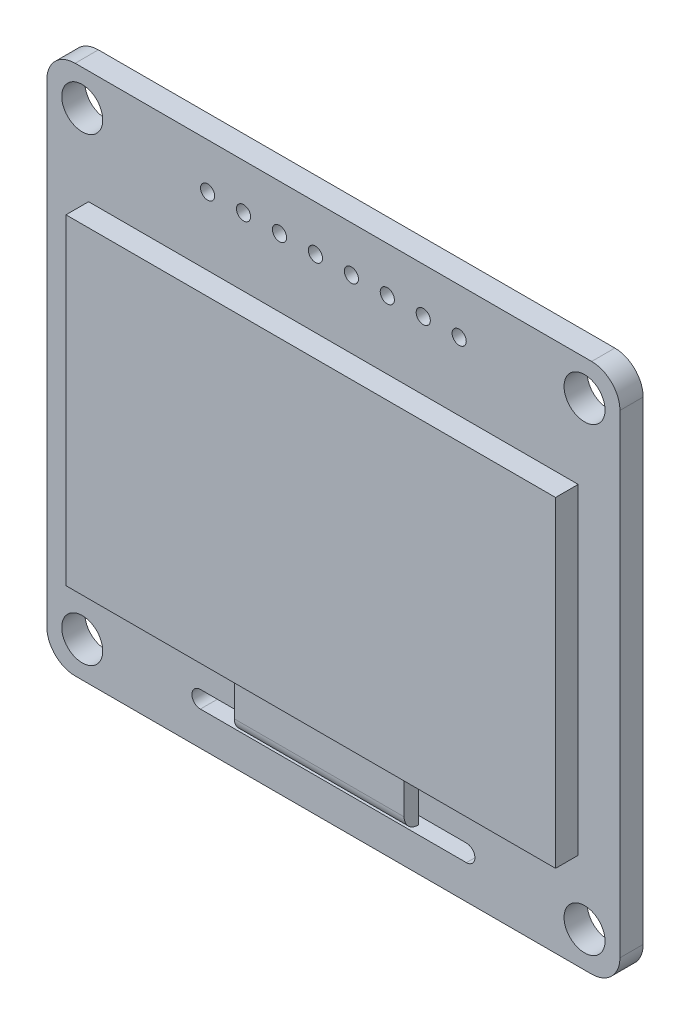
ISO-10303-21;
HEADER;
FILE_DESCRIPTION(('STEP AP214'),'2;1');
FILE_NAME('part.step','',(''),(''),'','','');
FILE_SCHEMA(('AUTOMOTIVE_DESIGN { 1 0 10303 214 1 1 1 1 }'));
ENDSEC;
DATA;
#1=APPLICATION_CONTEXT('core data for automotive mechanical design processes');
#2=APPLICATION_PROTOCOL_DEFINITION('international standard','automotive_design',2000,#1);
#3=PRODUCT_CONTEXT('',#1,'mechanical');
#4=PRODUCT('Part','Part','',(#3));
#5=PRODUCT_RELATED_PRODUCT_CATEGORY('part','',(#4));
#6=PRODUCT_DEFINITION_FORMATION('','',#4);
#7=PRODUCT_DEFINITION_CONTEXT('part definition',#1,'design');
#8=PRODUCT_DEFINITION('design','',#6,#7);
#9=PRODUCT_DEFINITION_SHAPE('','',#8);
#10=(LENGTH_UNIT() NAMED_UNIT(*) SI_UNIT(.MILLI.,.METRE.));
#11=(NAMED_UNIT(*) PLANE_ANGLE_UNIT() SI_UNIT($,.RADIAN.));
#12=(NAMED_UNIT(*) SI_UNIT($,.STERADIAN.) SOLID_ANGLE_UNIT());
#13=UNCERTAINTY_MEASURE_WITH_UNIT(LENGTH_MEASURE(1.E-05),#10,'distance_accuracy_value','');
#14=(GEOMETRIC_REPRESENTATION_CONTEXT(3) GLOBAL_UNCERTAINTY_ASSIGNED_CONTEXT((#13)) GLOBAL_UNIT_ASSIGNED_CONTEXT((#10,
#11,#12)) REPRESENTATION_CONTEXT('',''));
#15=CARTESIAN_POINT('',(0.,0.,0.));
#16=DIRECTION('',(0.,0.,1.));
#17=DIRECTION('',(1.,0.,0.));
#18=AXIS2_PLACEMENT_3D('',#15,#16,#17);
#19=CARTESIAN_POINT('',(6.,-14.75,1.64));
#20=DIRECTION('',(-1.,0.,0.));
#21=DIRECTION('',(0.,0.,1.));
#22=AXIS2_PLACEMENT_3D('',#19,#20,#21);
#23=CYLINDRICAL_SURFACE('',#22,1.);
#24=DIRECTION('',(1.,0.,0.));
#25=VECTOR('',#24,1.);
#26=CARTESIAN_POINT('',(0.,-15.75,1.64));
#27=LINE('',#26,#25);
#28=CARTESIAN_POINT('',(-6.,-15.75,1.64));
#29=VERTEX_POINT('',#28);
#30=CARTESIAN_POINT('',(6.,-15.75,1.64));
#31=VERTEX_POINT('',#30);
#32=EDGE_CURVE('E243',#29,#31,#27,.T.);
#33=ORIENTED_EDGE('',*,*,#32,.T.);
#34=CARTESIAN_POINT('',(6.,-14.75,1.64));
#35=DIRECTION('',(-1.,0.,0.));
#36=DIRECTION('',(0.,0.,1.));
#37=AXIS2_PLACEMENT_3D('',#34,#35,#36);
#38=CIRCLE('',#37,1.);
#39=CARTESIAN_POINT('',(6.,-14.75,2.64));
#40=VERTEX_POINT('',#39);
#41=EDGE_CURVE('E20',#40,#31,#38,.F.);
#42=ORIENTED_EDGE('',*,*,#41,.F.);
#43=DIRECTION('',(1.,0.,0.));
#44=VECTOR('',#43,1.);
#45=CARTESIAN_POINT('',(0.,-14.75,2.64));
#46=LINE('',#45,#44);
#47=CARTESIAN_POINT('',(-6.,-14.75,2.64));
#48=VERTEX_POINT('',#47);
#49=EDGE_CURVE('E244',#48,#40,#46,.T.);
#50=ORIENTED_EDGE('',*,*,#49,.F.);
#51=CARTESIAN_POINT('',(-6.,-14.75,1.64));
#52=DIRECTION('',(-1.,0.,0.));
#53=DIRECTION('',(0.,0.,1.));
#54=AXIS2_PLACEMENT_3D('',#51,#52,#53);
#55=CIRCLE('',#54,1.);
#56=EDGE_CURVE('E246',#29,#48,#55,.T.);
#57=ORIENTED_EDGE('',*,*,#56,.F.);
#58=EDGE_LOOP('',(#33,#42,#50,#57));
#59=FACE_BOUND('',#58,.T.);
#60=ADVANCED_FACE('F16',(#59),#23,.T.);
#61=CARTESIAN_POINT('',(-17.3,-11.95,3.24));
#62=DIRECTION('',(0.,0.,1.));
#63=DIRECTION('',(1.,0.,0.));
#64=AXIS2_PLACEMENT_3D('',#61,#62,#63);
#65=PLANE('',#64);
#66=DIRECTION('',(0.,1.,0.));
#67=VECTOR('',#66,1.);
#68=CARTESIAN_POINT('',(17.3,-0.6,3.24));
#69=LINE('',#68,#67);
#70=CARTESIAN_POINT('',(17.3,-11.95,3.24));
#71=VERTEX_POINT('',#70);
#72=CARTESIAN_POINT('',(17.3,10.75,3.24));
#73=VERTEX_POINT('',#72);
#74=EDGE_CURVE('E252',#71,#73,#69,.T.);
#75=ORIENTED_EDGE('',*,*,#74,.T.);
#76=DIRECTION('',(-1.,0.,0.));
#77=VECTOR('',#76,1.);
#78=CARTESIAN_POINT('',(0.,10.75,3.24));
#79=LINE('',#78,#77);
#80=CARTESIAN_POINT('',(-17.3,10.75,3.24));
#81=VERTEX_POINT('',#80);
#82=EDGE_CURVE('E263',#73,#81,#79,.T.);
#83=ORIENTED_EDGE('',*,*,#82,.T.);
#84=DIRECTION('',(0.,-1.,0.));
#85=VECTOR('',#84,1.);
#86=CARTESIAN_POINT('',(-17.3,-0.6,3.24));
#87=LINE('',#86,#85);
#88=CARTESIAN_POINT('',(-17.3,-11.95,3.24));
#89=VERTEX_POINT('',#88);
#90=EDGE_CURVE('E214',#81,#89,#87,.T.);
#91=ORIENTED_EDGE('',*,*,#90,.T.);
#92=DIRECTION('',(1.,0.,0.));
#93=VECTOR('',#92,1.);
#94=CARTESIAN_POINT('',(0.,-11.95,3.24));
#95=LINE('',#94,#93);
#96=EDGE_CURVE('E204',#89,#71,#95,.T.);
#97=ORIENTED_EDGE('',*,*,#96,.T.);
#98=EDGE_LOOP('',(#75,#83,#91,#97));
#99=FACE_BOUND('',#98,.T.);
#100=ADVANCED_FACE('F833',(#99),#65,.T.);
#101=CARTESIAN_POINT('',(-6.,-14.75,2.64));
#102=DIRECTION('',(0.,0.,1.));
#103=DIRECTION('',(1.,0.,0.));
#104=AXIS2_PLACEMENT_3D('',#101,#102,#103);
#105=PLANE('',#104);
#106=DIRECTION('',(0.,1.,0.));
#107=VECTOR('',#106,1.);
#108=CARTESIAN_POINT('',(6.,-13.8614,2.64));
#109=LINE('',#108,#107);
#110=CARTESIAN_POINT('',(6.00000000433333,-11.95,2.64));
#111=VERTEX_POINT('',#110);
#112=EDGE_CURVE('E384',#40,#111,#109,.T.);
#113=ORIENTED_EDGE('',*,*,#112,.T.);
#114=DIRECTION('',(-1.,0.,0.));
#115=VECTOR('',#114,1.);
#116=CARTESIAN_POINT('',(0.,-11.95,2.64));
#117=LINE('',#116,#115);
#118=CARTESIAN_POINT('',(-6.00000000866666,-11.95,2.64));
#119=VERTEX_POINT('',#118);
#120=EDGE_CURVE('E133',#111,#119,#117,.T.);
#121=ORIENTED_EDGE('',*,*,#120,.T.);
#122=DIRECTION('',(0.,-1.,0.));
#123=VECTOR('',#122,1.);
#124=CARTESIAN_POINT('',(-6.,-13.8614,2.64));
#125=LINE('',#124,#123);
#126=EDGE_CURVE('E187',#119,#48,#125,.T.);
#127=ORIENTED_EDGE('',*,*,#126,.T.);
#128=ORIENTED_EDGE('',*,*,#49,.T.);
#129=EDGE_LOOP('',(#113,#121,#127,#128));
#130=FACE_BOUND('',#129,.T.);
#131=ADVANCED_FACE('F383',(#130),#105,.T.);
#132=CARTESIAN_POINT('',(-6.,-15.75,1.64));
#133=DIRECTION('',(0.,0.,1.));
#134=DIRECTION('',(1.,0.,0.));
#135=AXIS2_PLACEMENT_3D('',#132,#133,#134);
#136=PLANE('',#135);
#137=DIRECTION('',(1.,0.,0.));
#138=VECTOR('',#137,1.);
#139=CARTESIAN_POINT('',(0.,-15.15,1.64));
#140=LINE('',#139,#138);
#141=CARTESIAN_POINT('',(-5.9999999962,-15.1500000004219,1.64));
#142=VERTEX_POINT('',#141);
#143=CARTESIAN_POINT('',(5.9999999955,-15.1500000004219,1.64));
#144=VERTEX_POINT('',#143);
#145=EDGE_CURVE('E168',#142,#144,#140,.T.);
#146=ORIENTED_EDGE('',*,*,#145,.T.);
#147=DIRECTION('',(0.,-1.,0.));
#148=VECTOR('',#147,1.);
#149=CARTESIAN_POINT('',(6.,-13.8614,1.64));
#150=LINE('',#149,#148);
#151=EDGE_CURVE('E385',#144,#31,#150,.T.);
#152=ORIENTED_EDGE('',*,*,#151,.T.);
#153=ORIENTED_EDGE('',*,*,#32,.F.);
#154=DIRECTION('',(0.,1.,0.));
#155=VECTOR('',#154,1.);
#156=CARTESIAN_POINT('',(-6.,-13.8614,1.64));
#157=LINE('',#156,#155);
#158=EDGE_CURVE('E212',#29,#142,#157,.T.);
#159=ORIENTED_EDGE('',*,*,#158,.T.);
#160=EDGE_LOOP('',(#146,#152,#153,#159));
#161=FACE_BOUND('',#160,.T.);
#162=ADVANCED_FACE('F817',(#161),#136,.F.);
#163=CARTESIAN_POINT('',(-20.25,-16.75,0.));
#164=DIRECTION('',(1.,0.,0.));
#165=DIRECTION('',(0.,1.,0.));
#166=AXIS2_PLACEMENT_3D('',#163,#164,#165);
#167=PLANE('',#166);
#168=DIRECTION('',(0.,0.,-1.));
#169=VECTOR('',#168,1.);
#170=CARTESIAN_POINT('',(-20.25,-16.7500000003592,0.82));
#171=LINE('',#170,#169);
#172=CARTESIAN_POINT('',(-20.25,-16.7500000001796,0.));
#173=VERTEX_POINT('',#172);
#174=CARTESIAN_POINT('',(-20.25,-16.7500000001796,1.64));
#175=VERTEX_POINT('',#174);
#176=EDGE_CURVE('E240',#173,#175,#171,.F.);
#177=ORIENTED_EDGE('',*,*,#176,.T.);
#178=DIRECTION('',(0.,-1.,0.));
#179=VECTOR('',#178,1.);
#180=CARTESIAN_POINT('',(-20.25,0.,1.64));
#181=LINE('',#180,#179);
#182=CARTESIAN_POINT('',(-20.25,16.75,1.64));
#183=VERTEX_POINT('',#182);
#184=EDGE_CURVE('E322',#183,#175,#181,.T.);
#185=ORIENTED_EDGE('',*,*,#184,.F.);
#186=DIRECTION('',(0.,0.,1.));
#187=VECTOR('',#186,1.);
#188=CARTESIAN_POINT('',(-20.25,16.75,0.82));
#189=LINE('',#188,#187);
#190=CARTESIAN_POINT('',(-20.25,16.75,0.));
#191=VERTEX_POINT('',#190);
#192=EDGE_CURVE('E223',#183,#191,#189,.F.);
#193=ORIENTED_EDGE('',*,*,#192,.T.);
#194=DIRECTION('',(0.,-1.,0.));
#195=VECTOR('',#194,1.);
#196=CARTESIAN_POINT('',(-20.25,0.,0.));
#197=LINE('',#196,#195);
#198=EDGE_CURVE('E368',#191,#173,#197,.T.);
#199=ORIENTED_EDGE('',*,*,#198,.T.);
#200=EDGE_LOOP('',(#177,#185,#193,#199));
#201=FACE_BOUND('',#200,.T.);
#202=ADVANCED_FACE('F488',(#201),#167,.F.);
#203=CARTESIAN_POINT('',(-18.25,-16.75,1.64));
#204=DIRECTION('',(0.,0.,-1.));
#205=DIRECTION('',(0.,1.,0.));
#206=AXIS2_PLACEMENT_3D('',#203,#204,#205);
#207=CYLINDRICAL_SURFACE('',#206,2.);
#208=ORIENTED_EDGE('',*,*,#176,.F.);
#209=CARTESIAN_POINT('',(-18.25,-16.75,0.));
#210=DIRECTION('',(0.,0.,-1.));
#211=DIRECTION('',(0.,1.,0.));
#212=AXIS2_PLACEMENT_3D('',#209,#210,#211);
#213=CIRCLE('',#212,2.);
#214=CARTESIAN_POINT('',(-18.25,-18.75,0.));
#215=VERTEX_POINT('',#214);
#216=EDGE_CURVE('E365',#173,#215,#213,.F.);
#217=ORIENTED_EDGE('',*,*,#216,.T.);
#218=DIRECTION('',(0.,0.,1.));
#219=VECTOR('',#218,1.);
#220=CARTESIAN_POINT('',(-18.25,-18.75,0.82));
#221=LINE('',#220,#219);
#222=CARTESIAN_POINT('',(-18.25,-18.75,1.64));
#223=VERTEX_POINT('',#222);
#224=EDGE_CURVE('E237',#215,#223,#221,.T.);
#225=ORIENTED_EDGE('',*,*,#224,.T.);
#226=CARTESIAN_POINT('',(-18.25,-16.75,1.64));
#227=DIRECTION('',(0.,0.,-1.));
#228=DIRECTION('',(0.,1.,0.));
#229=AXIS2_PLACEMENT_3D('',#226,#227,#228);
#230=CIRCLE('',#229,2.);
#231=EDGE_CURVE('E320',#175,#223,#230,.F.);
#232=ORIENTED_EDGE('',*,*,#231,.F.);
#233=EDGE_LOOP('',(#208,#217,#225,#232));
#234=FACE_BOUND('',#233,.T.);
#235=ADVANCED_FACE('F495',(#234),#207,.T.);
#236=CARTESIAN_POINT('',(-18.25,-18.75,0.));
#237=DIRECTION('',(0.,1.,0.));
#238=DIRECTION('',(0.,0.,1.));
#239=AXIS2_PLACEMENT_3D('',#236,#237,#238);
#240=PLANE('',#239);
#241=ORIENTED_EDGE('',*,*,#224,.F.);
#242=DIRECTION('',(1.,0.,0.));
#243=VECTOR('',#242,1.);
#244=CARTESIAN_POINT('',(0.,-18.75,0.));
#245=LINE('',#244,#243);
#246=CARTESIAN_POINT('',(18.2500000003847,-18.75,0.));
#247=VERTEX_POINT('',#246);
#248=EDGE_CURVE('E364',#215,#247,#245,.T.);
#249=ORIENTED_EDGE('',*,*,#248,.T.);
#250=DIRECTION('',(0.,0.,-1.));
#251=VECTOR('',#250,1.);
#252=CARTESIAN_POINT('',(18.2500000007694,-18.75,0.82));
#253=LINE('',#252,#251);
#254=CARTESIAN_POINT('',(18.2500000003847,-18.75,1.64));
#255=VERTEX_POINT('',#254);
#256=EDGE_CURVE('E234',#247,#255,#253,.F.);
#257=ORIENTED_EDGE('',*,*,#256,.T.);
#258=DIRECTION('',(1.,0.,0.));
#259=VECTOR('',#258,1.);
#260=CARTESIAN_POINT('',(0.,-18.75,1.64));
#261=LINE('',#260,#259);
#262=EDGE_CURVE('E319',#223,#255,#261,.T.);
#263=ORIENTED_EDGE('',*,*,#262,.F.);
#264=EDGE_LOOP('',(#241,#249,#257,#263));
#265=FACE_BOUND('',#264,.T.);
#266=ADVANCED_FACE('F500',(#265),#240,.F.);
#267=CARTESIAN_POINT('',(18.25,-16.75,1.64));
#268=DIRECTION('',(0.,0.,-1.));
#269=DIRECTION('',(0.,1.,0.));
#270=AXIS2_PLACEMENT_3D('',#267,#268,#269);
#271=CYLINDRICAL_SURFACE('',#270,2.);
#272=ORIENTED_EDGE('',*,*,#256,.F.);
#273=CARTESIAN_POINT('',(18.25,-16.75,0.));
#274=DIRECTION('',(0.,0.,-1.));
#275=DIRECTION('',(0.,1.,0.));
#276=AXIS2_PLACEMENT_3D('',#273,#274,#275);
#277=CIRCLE('',#276,2.);
#278=CARTESIAN_POINT('',(20.25,-16.75,0.));
#279=VERTEX_POINT('',#278);
#280=EDGE_CURVE('E377',#247,#279,#277,.F.);
#281=ORIENTED_EDGE('',*,*,#280,.T.);
#282=DIRECTION('',(0.,0.,1.));
#283=VECTOR('',#282,1.);
#284=CARTESIAN_POINT('',(20.25,-16.75,0.82));
#285=LINE('',#284,#283);
#286=CARTESIAN_POINT('',(20.25,-16.75,1.64));
#287=VERTEX_POINT('',#286);
#288=EDGE_CURVE('E231',#279,#287,#285,.T.);
#289=ORIENTED_EDGE('',*,*,#288,.T.);
#290=CARTESIAN_POINT('',(18.25,-16.75,1.64));
#291=DIRECTION('',(0.,0.,-1.));
#292=DIRECTION('',(0.,1.,0.));
#293=AXIS2_PLACEMENT_3D('',#290,#291,#292);
#294=CIRCLE('',#293,2.);
#295=EDGE_CURVE('E317',#255,#287,#294,.F.);
#296=ORIENTED_EDGE('',*,*,#295,.F.);
#297=EDGE_LOOP('',(#272,#281,#289,#296));
#298=FACE_BOUND('',#297,.T.);
#299=ADVANCED_FACE('F502',(#298),#271,.T.);
#300=CARTESIAN_POINT('',(20.25,16.75,0.));
#301=DIRECTION('',(-1.,0.,0.));
#302=DIRECTION('',(0.,-1.,0.));
#303=AXIS2_PLACEMENT_3D('',#300,#301,#302);
#304=PLANE('',#303);
#305=ORIENTED_EDGE('',*,*,#288,.F.);
#306=DIRECTION('',(0.,1.,0.));
#307=VECTOR('',#306,1.);
#308=CARTESIAN_POINT('',(20.25,0.,0.));
#309=LINE('',#308,#307);
#310=CARTESIAN_POINT('',(20.25,16.7499999995898,0.));
#311=VERTEX_POINT('',#310);
#312=EDGE_CURVE('E376',#279,#311,#309,.T.);
#313=ORIENTED_EDGE('',*,*,#312,.T.);
#314=DIRECTION('',(0.,0.,-1.));
#315=VECTOR('',#314,1.);
#316=CARTESIAN_POINT('',(20.25,16.7499999991796,0.82));
#317=LINE('',#316,#315);
#318=CARTESIAN_POINT('',(20.25,16.7499999995898,1.64));
#319=VERTEX_POINT('',#318);
#320=EDGE_CURVE('E228',#311,#319,#317,.F.);
#321=ORIENTED_EDGE('',*,*,#320,.T.);
#322=DIRECTION('',(0.,1.,0.));
#323=VECTOR('',#322,1.);
#324=CARTESIAN_POINT('',(20.25,0.,1.64));
#325=LINE('',#324,#323);
#326=EDGE_CURVE('E316',#287,#319,#325,.T.);
#327=ORIENTED_EDGE('',*,*,#326,.F.);
#328=EDGE_LOOP('',(#305,#313,#321,#327));
#329=FACE_BOUND('',#328,.T.);
#330=ADVANCED_FACE('F506',(#329),#304,.F.);
#331=CARTESIAN_POINT('',(18.25,16.75,1.64));
#332=DIRECTION('',(0.,0.,-1.));
#333=DIRECTION('',(0.,1.,0.));
#334=AXIS2_PLACEMENT_3D('',#331,#332,#333);
#335=CYLINDRICAL_SURFACE('',#334,2.);
#336=ORIENTED_EDGE('',*,*,#320,.F.);
#337=CARTESIAN_POINT('',(18.25,16.75,0.));
#338=DIRECTION('',(0.,0.,-1.));
#339=DIRECTION('',(0.,1.,0.));
#340=AXIS2_PLACEMENT_3D('',#337,#338,#339);
#341=CIRCLE('',#340,2.);
#342=CARTESIAN_POINT('',(18.25,18.75,0.));
#343=VERTEX_POINT('',#342);
#344=EDGE_CURVE('E373',#311,#343,#341,.F.);
#345=ORIENTED_EDGE('',*,*,#344,.T.);
#346=DIRECTION('',(0.,0.,1.));
#347=VECTOR('',#346,1.);
#348=CARTESIAN_POINT('',(18.25,18.75,0.82));
#349=LINE('',#348,#347);
#350=CARTESIAN_POINT('',(18.25,18.75,1.64));
#351=VERTEX_POINT('',#350);
#352=EDGE_CURVE('E225',#343,#351,#349,.T.);
#353=ORIENTED_EDGE('',*,*,#352,.T.);
#354=CARTESIAN_POINT('',(18.25,16.75,1.64));
#355=DIRECTION('',(0.,0.,-1.));
#356=DIRECTION('',(0.,1.,0.));
#357=AXIS2_PLACEMENT_3D('',#354,#355,#356);
#358=CIRCLE('',#357,2.);
#359=EDGE_CURVE('E314',#319,#351,#358,.F.);
#360=ORIENTED_EDGE('',*,*,#359,.F.);
#361=EDGE_LOOP('',(#336,#345,#353,#360));
#362=FACE_BOUND('',#361,.T.);
#363=ADVANCED_FACE('F509',(#362),#335,.T.);
#364=CARTESIAN_POINT('',(-18.25,18.75,1.64));
#365=DIRECTION('',(0.,-1.,0.));
#366=DIRECTION('',(0.,0.,-1.));
#367=AXIS2_PLACEMENT_3D('',#364,#365,#366);
#368=PLANE('',#367);
#369=ORIENTED_EDGE('',*,*,#352,.F.);
#370=DIRECTION('',(-1.,0.,0.));
#371=VECTOR('',#370,1.);
#372=CARTESIAN_POINT('',(0.,18.75,0.));
#373=LINE('',#372,#371);
#374=CARTESIAN_POINT('',(-18.2499999997949,18.75,0.));
#375=VERTEX_POINT('',#374);
#376=EDGE_CURVE('E372',#343,#375,#373,.T.);
#377=ORIENTED_EDGE('',*,*,#376,.T.);
#378=DIRECTION('',(0.,0.,-1.));
#379=VECTOR('',#378,1.);
#380=CARTESIAN_POINT('',(-18.2499999995898,18.75,0.82));
#381=LINE('',#380,#379);
#382=CARTESIAN_POINT('',(-18.2499999997949,18.75,1.64));
#383=VERTEX_POINT('',#382);
#384=EDGE_CURVE('E218',#375,#383,#381,.F.);
#385=ORIENTED_EDGE('',*,*,#384,.T.);
#386=DIRECTION('',(-1.,0.,0.));
#387=VECTOR('',#386,1.);
#388=CARTESIAN_POINT('',(0.,18.75,1.64));
#389=LINE('',#388,#387);
#390=EDGE_CURVE('E313',#351,#383,#389,.T.);
#391=ORIENTED_EDGE('',*,*,#390,.F.);
#392=EDGE_LOOP('',(#369,#377,#385,#391));
#393=FACE_BOUND('',#392,.T.);
#394=ADVANCED_FACE('F481',(#393),#368,.F.);
#395=CARTESIAN_POINT('',(-18.25,16.75,1.64));
#396=DIRECTION('',(0.,0.,-1.));
#397=DIRECTION('',(0.,1.,0.));
#398=AXIS2_PLACEMENT_3D('',#395,#396,#397);
#399=CYLINDRICAL_SURFACE('',#398,2.);
#400=ORIENTED_EDGE('',*,*,#384,.F.);
#401=CARTESIAN_POINT('',(-18.25,16.75,0.));
#402=DIRECTION('',(0.,0.,-1.));
#403=DIRECTION('',(0.,1.,0.));
#404=AXIS2_PLACEMENT_3D('',#401,#402,#403);
#405=CIRCLE('',#404,2.);
#406=EDGE_CURVE('E369',#375,#191,#405,.F.);
#407=ORIENTED_EDGE('',*,*,#406,.T.);
#408=ORIENTED_EDGE('',*,*,#192,.F.);
#409=CARTESIAN_POINT('',(-18.25,16.75,1.64));
#410=DIRECTION('',(0.,0.,-1.));
#411=DIRECTION('',(0.,1.,0.));
#412=AXIS2_PLACEMENT_3D('',#409,#410,#411);
#413=CIRCLE('',#412,2.);
#414=EDGE_CURVE('E310',#383,#183,#413,.F.);
#415=ORIENTED_EDGE('',*,*,#414,.F.);
#416=EDGE_LOOP('',(#400,#407,#408,#415));
#417=FACE_BOUND('',#416,.T.);
#418=ADVANCED_FACE('F485',(#417),#399,.T.);
#419=CARTESIAN_POINT('',(-3.81,15.55,0.));
#420=DIRECTION('',(0.,0.,1.));
#421=DIRECTION('',(1.,0.,0.));
#422=AXIS2_PLACEMENT_3D('',#419,#420,#421);
#423=CYLINDRICAL_SURFACE('',#422,0.5);
#424=CARTESIAN_POINT('',(-3.81,15.55,1.64));
#425=DIRECTION('',(0.,0.,1.));
#426=DIRECTION('',(1.,0.,0.));
#427=AXIS2_PLACEMENT_3D('',#424,#425,#426);
#428=CIRCLE('',#427,0.5);
#429=CARTESIAN_POINT('',(-3.31,15.55,1.64));
#430=VERTEX_POINT('',#429);
#431=EDGE_CURVE('E307',#430,#430,#428,.F.);
#432=ORIENTED_EDGE('',*,*,#431,.F.);
#433=EDGE_LOOP('',(#432));
#434=FACE_BOUND('',#433,.T.);
#435=CARTESIAN_POINT('',(-3.81,15.55,0.));
#436=DIRECTION('',(0.,0.,1.));
#437=DIRECTION('',(1.,0.,0.));
#438=AXIS2_PLACEMENT_3D('',#435,#436,#437);
#439=CIRCLE('',#438,0.5);
#440=CARTESIAN_POINT('',(-3.31,15.55,0.));
#441=VERTEX_POINT('',#440);
#442=EDGE_CURVE('E361',#441,#441,#439,.F.);
#443=ORIENTED_EDGE('',*,*,#442,.T.);
#444=EDGE_LOOP('',(#443));
#445=FACE_BOUND('',#444,.T.);
#446=ADVANCED_FACE('F579',(#434,#445),#423,.F.);
#447=CARTESIAN_POINT('',(-1.27,15.55,0.));
#448=DIRECTION('',(0.,0.,1.));
#449=DIRECTION('',(1.,0.,0.));
#450=AXIS2_PLACEMENT_3D('',#447,#448,#449);
#451=CYLINDRICAL_SURFACE('',#450,0.5);
#452=CARTESIAN_POINT('',(-1.27,15.55,1.64));
#453=DIRECTION('',(0.,0.,1.));
#454=DIRECTION('',(1.,0.,0.));
#455=AXIS2_PLACEMENT_3D('',#452,#453,#454);
#456=CIRCLE('',#455,0.5);
#457=CARTESIAN_POINT('',(-0.77,15.55,1.64));
#458=VERTEX_POINT('',#457);
#459=EDGE_CURVE('E304',#458,#458,#456,.F.);
#460=ORIENTED_EDGE('',*,*,#459,.F.);
#461=EDGE_LOOP('',(#460));
#462=FACE_BOUND('',#461,.T.);
#463=CARTESIAN_POINT('',(-1.27,15.55,0.));
#464=DIRECTION('',(0.,0.,1.));
#465=DIRECTION('',(1.,0.,0.));
#466=AXIS2_PLACEMENT_3D('',#463,#464,#465);
#467=CIRCLE('',#466,0.5);
#468=CARTESIAN_POINT('',(-0.77,15.55,0.));
#469=VERTEX_POINT('',#468);
#470=EDGE_CURVE('E358',#469,#469,#467,.F.);
#471=ORIENTED_EDGE('',*,*,#470,.T.);
#472=EDGE_LOOP('',(#471));
#473=FACE_BOUND('',#472,.T.);
#474=ADVANCED_FACE('F575',(#462,#473),#451,.F.);
#475=CARTESIAN_POINT('',(1.27,15.55,0.));
#476=DIRECTION('',(0.,0.,1.));
#477=DIRECTION('',(1.,0.,0.));
#478=AXIS2_PLACEMENT_3D('',#475,#476,#477);
#479=CYLINDRICAL_SURFACE('',#478,0.5);
#480=CARTESIAN_POINT('',(1.27,15.55,1.64));
#481=DIRECTION('',(0.,0.,1.));
#482=DIRECTION('',(1.,0.,0.));
#483=AXIS2_PLACEMENT_3D('',#480,#481,#482);
#484=CIRCLE('',#483,0.5);
#485=CARTESIAN_POINT('',(1.77,15.55,1.64));
#486=VERTEX_POINT('',#485);
#487=EDGE_CURVE('E301',#486,#486,#484,.F.);
#488=ORIENTED_EDGE('',*,*,#487,.F.);
#489=EDGE_LOOP('',(#488));
#490=FACE_BOUND('',#489,.T.);
#491=CARTESIAN_POINT('',(1.27,15.55,0.));
#492=DIRECTION('',(0.,0.,1.));
#493=DIRECTION('',(1.,0.,0.));
#494=AXIS2_PLACEMENT_3D('',#491,#492,#493);
#495=CIRCLE('',#494,0.5);
#496=CARTESIAN_POINT('',(1.77,15.55,0.));
#497=VERTEX_POINT('',#496);
#498=EDGE_CURVE('E355',#497,#497,#495,.F.);
#499=ORIENTED_EDGE('',*,*,#498,.T.);
#500=EDGE_LOOP('',(#499));
#501=FACE_BOUND('',#500,.T.);
#502=ADVANCED_FACE('F571',(#490,#501),#479,.F.);
#503=CARTESIAN_POINT('',(3.81,15.55,0.));
#504=DIRECTION('',(0.,0.,1.));
#505=DIRECTION('',(1.,0.,0.));
#506=AXIS2_PLACEMENT_3D('',#503,#504,#505);
#507=CYLINDRICAL_SURFACE('',#506,0.5);
#508=CARTESIAN_POINT('',(3.81,15.55,1.64));
#509=DIRECTION('',(0.,0.,1.));
#510=DIRECTION('',(1.,0.,0.));
#511=AXIS2_PLACEMENT_3D('',#508,#509,#510);
#512=CIRCLE('',#511,0.5);
#513=CARTESIAN_POINT('',(4.31,15.55,1.64));
#514=VERTEX_POINT('',#513);
#515=EDGE_CURVE('E298',#514,#514,#512,.F.);
#516=ORIENTED_EDGE('',*,*,#515,.F.);
#517=EDGE_LOOP('',(#516));
#518=FACE_BOUND('',#517,.T.);
#519=CARTESIAN_POINT('',(3.81,15.55,0.));
#520=DIRECTION('',(0.,0.,1.));
#521=DIRECTION('',(1.,0.,0.));
#522=AXIS2_PLACEMENT_3D('',#519,#520,#521);
#523=CIRCLE('',#522,0.5);
#524=CARTESIAN_POINT('',(4.31,15.55,0.));
#525=VERTEX_POINT('',#524);
#526=EDGE_CURVE('E352',#525,#525,#523,.F.);
#527=ORIENTED_EDGE('',*,*,#526,.T.);
#528=EDGE_LOOP('',(#527));
#529=FACE_BOUND('',#528,.T.);
#530=ADVANCED_FACE('F567',(#518,#529),#507,.F.);
#531=CARTESIAN_POINT('',(6.35,15.55,0.));
#532=DIRECTION('',(0.,0.,1.));
#533=DIRECTION('',(1.,0.,0.));
#534=AXIS2_PLACEMENT_3D('',#531,#532,#533);
#535=CYLINDRICAL_SURFACE('',#534,0.5);
#536=CARTESIAN_POINT('',(6.35,15.55,1.64));
#537=DIRECTION('',(0.,0.,1.));
#538=DIRECTION('',(1.,0.,0.));
#539=AXIS2_PLACEMENT_3D('',#536,#537,#538);
#540=CIRCLE('',#539,0.5);
#541=CARTESIAN_POINT('',(6.85,15.55,1.64));
#542=VERTEX_POINT('',#541);
#543=EDGE_CURVE('E295',#542,#542,#540,.F.);
#544=ORIENTED_EDGE('',*,*,#543,.F.);
#545=EDGE_LOOP('',(#544));
#546=FACE_BOUND('',#545,.T.);
#547=CARTESIAN_POINT('',(6.35,15.55,0.));
#548=DIRECTION('',(0.,0.,1.));
#549=DIRECTION('',(1.,0.,0.));
#550=AXIS2_PLACEMENT_3D('',#547,#548,#549);
#551=CIRCLE('',#550,0.5);
#552=CARTESIAN_POINT('',(6.85,15.55,0.));
#553=VERTEX_POINT('',#552);
#554=EDGE_CURVE('E349',#553,#553,#551,.F.);
#555=ORIENTED_EDGE('',*,*,#554,.T.);
#556=EDGE_LOOP('',(#555));
#557=FACE_BOUND('',#556,.T.);
#558=ADVANCED_FACE('F563',(#546,#557),#535,.F.);
#559=CARTESIAN_POINT('',(8.89,15.55,0.));
#560=DIRECTION('',(0.,0.,1.));
#561=DIRECTION('',(1.,0.,0.));
#562=AXIS2_PLACEMENT_3D('',#559,#560,#561);
#563=CYLINDRICAL_SURFACE('',#562,0.5);
#564=CARTESIAN_POINT('',(8.89,15.55,1.64));
#565=DIRECTION('',(0.,0.,1.));
#566=DIRECTION('',(1.,0.,0.));
#567=AXIS2_PLACEMENT_3D('',#564,#565,#566);
#568=CIRCLE('',#567,0.5);
#569=CARTESIAN_POINT('',(9.39,15.55,1.64));
#570=VERTEX_POINT('',#569);
#571=EDGE_CURVE('E292',#570,#570,#568,.F.);
#572=ORIENTED_EDGE('',*,*,#571,.F.);
#573=EDGE_LOOP('',(#572));
#574=FACE_BOUND('',#573,.T.);
#575=CARTESIAN_POINT('',(8.89,15.55,0.));
#576=DIRECTION('',(0.,0.,1.));
#577=DIRECTION('',(1.,0.,0.));
#578=AXIS2_PLACEMENT_3D('',#575,#576,#577);
#579=CIRCLE('',#578,0.5);
#580=CARTESIAN_POINT('',(9.39,15.55,0.));
#581=VERTEX_POINT('',#580);
#582=EDGE_CURVE('E346',#581,#581,#579,.F.);
#583=ORIENTED_EDGE('',*,*,#582,.T.);
#584=EDGE_LOOP('',(#583));
#585=FACE_BOUND('',#584,.T.);
#586=ADVANCED_FACE('F559',(#574,#585),#563,.F.);
#587=CARTESIAN_POINT('',(-8.89,15.55,0.));
#588=DIRECTION('',(0.,0.,1.));
#589=DIRECTION('',(1.,0.,0.));
#590=AXIS2_PLACEMENT_3D('',#587,#588,#589);
#591=CYLINDRICAL_SURFACE('',#590,0.5);
#592=CARTESIAN_POINT('',(-8.89,15.55,1.64));
#593=DIRECTION('',(0.,0.,1.));
#594=DIRECTION('',(1.,0.,0.));
#595=AXIS2_PLACEMENT_3D('',#592,#593,#594);
#596=CIRCLE('',#595,0.5);
#597=CARTESIAN_POINT('',(-8.39,15.55,1.64));
#598=VERTEX_POINT('',#597);
#599=EDGE_CURVE('E289',#598,#598,#596,.F.);
#600=ORIENTED_EDGE('',*,*,#599,.F.);
#601=EDGE_LOOP('',(#600));
#602=FACE_BOUND('',#601,.T.);
#603=CARTESIAN_POINT('',(-8.89,15.55,0.));
#604=DIRECTION('',(0.,0.,1.));
#605=DIRECTION('',(1.,0.,0.));
#606=AXIS2_PLACEMENT_3D('',#603,#604,#605);
#607=CIRCLE('',#606,0.5);
#608=CARTESIAN_POINT('',(-8.39,15.55,0.));
#609=VERTEX_POINT('',#608);
#610=EDGE_CURVE('E343',#609,#609,#607,.F.);
#611=ORIENTED_EDGE('',*,*,#610,.T.);
#612=EDGE_LOOP('',(#611));
#613=FACE_BOUND('',#612,.T.);
#614=ADVANCED_FACE('F555',(#602,#613),#591,.F.);
#615=CARTESIAN_POINT('',(17.75,16.25,0.));
#616=DIRECTION('',(0.,0.,1.));
#617=DIRECTION('',(1.,0.,0.));
#618=AXIS2_PLACEMENT_3D('',#615,#616,#617);
#619=CYLINDRICAL_SURFACE('',#618,1.45);
#620=CARTESIAN_POINT('',(17.75,16.25,1.64));
#621=DIRECTION('',(0.,0.,1.));
#622=DIRECTION('',(1.,0.,0.));
#623=AXIS2_PLACEMENT_3D('',#620,#621,#622);
#624=CIRCLE('',#623,1.45);
#625=CARTESIAN_POINT('',(19.2,16.25,1.64));
#626=VERTEX_POINT('',#625);
#627=EDGE_CURVE('E286',#626,#626,#624,.F.);
#628=ORIENTED_EDGE('',*,*,#627,.F.);
#629=EDGE_LOOP('',(#628));
#630=FACE_BOUND('',#629,.T.);
#631=CARTESIAN_POINT('',(17.75,16.25,0.));
#632=DIRECTION('',(0.,0.,1.));
#633=DIRECTION('',(1.,0.,0.));
#634=AXIS2_PLACEMENT_3D('',#631,#632,#633);
#635=CIRCLE('',#634,1.45);
#636=CARTESIAN_POINT('',(19.2,16.25,0.));
#637=VERTEX_POINT('',#636);
#638=EDGE_CURVE('E332',#637,#637,#635,.F.);
#639=ORIENTED_EDGE('',*,*,#638,.T.);
#640=EDGE_LOOP('',(#639));
#641=FACE_BOUND('',#640,.T.);
#642=ADVANCED_FACE('F551',(#630,#641),#619,.F.);
#643=CARTESIAN_POINT('',(17.75,-16.25,0.));
#644=DIRECTION('',(0.,0.,1.));
#645=DIRECTION('',(1.,0.,0.));
#646=AXIS2_PLACEMENT_3D('',#643,#644,#645);
#647=CYLINDRICAL_SURFACE('',#646,1.45);
#648=CARTESIAN_POINT('',(17.75,-16.25,1.64));
#649=DIRECTION('',(0.,0.,1.));
#650=DIRECTION('',(1.,0.,0.));
#651=AXIS2_PLACEMENT_3D('',#648,#649,#650);
#652=CIRCLE('',#651,1.45);
#653=CARTESIAN_POINT('',(19.2,-16.25,1.64));
#654=VERTEX_POINT('',#653);
#655=EDGE_CURVE('E283',#654,#654,#652,.F.);
#656=ORIENTED_EDGE('',*,*,#655,.F.);
#657=EDGE_LOOP('',(#656));
#658=FACE_BOUND('',#657,.T.);
#659=CARTESIAN_POINT('',(17.75,-16.25,0.));
#660=DIRECTION('',(0.,0.,1.));
#661=DIRECTION('',(1.,0.,0.));
#662=AXIS2_PLACEMENT_3D('',#659,#660,#661);
#663=CIRCLE('',#662,1.45);
#664=CARTESIAN_POINT('',(19.2,-16.25,0.));
#665=VERTEX_POINT('',#664);
#666=EDGE_CURVE('E329',#665,#665,#663,.F.);
#667=ORIENTED_EDGE('',*,*,#666,.T.);
#668=EDGE_LOOP('',(#667));
#669=FACE_BOUND('',#668,.T.);
#670=ADVANCED_FACE('F547',(#658,#669),#647,.F.);
#671=CARTESIAN_POINT('',(-17.75,-16.25,0.));
#672=DIRECTION('',(0.,0.,1.));
#673=DIRECTION('',(1.,0.,0.));
#674=AXIS2_PLACEMENT_3D('',#671,#672,#673);
#675=CYLINDRICAL_SURFACE('',#674,1.45);
#676=CARTESIAN_POINT('',(-17.75,-16.25,1.64));
#677=DIRECTION('',(0.,0.,1.));
#678=DIRECTION('',(1.,0.,0.));
#679=AXIS2_PLACEMENT_3D('',#676,#677,#678);
#680=CIRCLE('',#679,1.45);
#681=CARTESIAN_POINT('',(-16.3,-16.25,1.64));
#682=VERTEX_POINT('',#681);
#683=EDGE_CURVE('E280',#682,#682,#680,.F.);
#684=ORIENTED_EDGE('',*,*,#683,.F.);
#685=EDGE_LOOP('',(#684));
#686=FACE_BOUND('',#685,.T.);
#687=CARTESIAN_POINT('',(-17.75,-16.25,0.));
#688=DIRECTION('',(0.,0.,1.));
#689=DIRECTION('',(1.,0.,0.));
#690=AXIS2_PLACEMENT_3D('',#687,#688,#689);
#691=CIRCLE('',#690,1.45);
#692=CARTESIAN_POINT('',(-16.3,-16.25,0.));
#693=VERTEX_POINT('',#692);
#694=EDGE_CURVE('E326',#693,#693,#691,.F.);
#695=ORIENTED_EDGE('',*,*,#694,.T.);
#696=EDGE_LOOP('',(#695));
#697=FACE_BOUND('',#696,.T.);
#698=ADVANCED_FACE('F543',(#686,#697),#675,.F.);
#699=CARTESIAN_POINT('',(-17.75,16.25,0.));
#700=DIRECTION('',(0.,0.,1.));
#701=DIRECTION('',(1.,0.,0.));
#702=AXIS2_PLACEMENT_3D('',#699,#700,#701);
#703=CYLINDRICAL_SURFACE('',#702,1.45);
#704=CARTESIAN_POINT('',(-17.75,16.25,1.64));
#705=DIRECTION('',(0.,0.,1.));
#706=DIRECTION('',(1.,0.,0.));
#707=AXIS2_PLACEMENT_3D('',#704,#705,#706);
#708=CIRCLE('',#707,1.45);
#709=CARTESIAN_POINT('',(-16.3,16.25,1.64));
#710=VERTEX_POINT('',#709);
#711=EDGE_CURVE('E277',#710,#710,#708,.F.);
#712=ORIENTED_EDGE('',*,*,#711,.F.);
#713=EDGE_LOOP('',(#712));
#714=FACE_BOUND('',#713,.T.);
#715=CARTESIAN_POINT('',(-17.75,16.25,0.));
#716=DIRECTION('',(0.,0.,1.));
#717=DIRECTION('',(1.,0.,0.));
#718=AXIS2_PLACEMENT_3D('',#715,#716,#717);
#719=CIRCLE('',#718,1.45);
#720=CARTESIAN_POINT('',(-16.3,16.25,0.));
#721=VERTEX_POINT('',#720);
#722=EDGE_CURVE('E323',#721,#721,#719,.F.);
#723=ORIENTED_EDGE('',*,*,#722,.T.);
#724=EDGE_LOOP('',(#723));
#725=FACE_BOUND('',#724,.T.);
#726=ADVANCED_FACE('F540',(#714,#725),#703,.F.);
#727=CARTESIAN_POINT('',(-6.,-15.7728,1.64));
#728=DIRECTION('',(1.,0.,0.));
#729=DIRECTION('',(0.,1.,0.));
#730=AXIS2_PLACEMENT_3D('',#727,#728,#729);
#731=PLANE('',#730);
#732=ORIENTED_EDGE('',*,*,#56,.T.);
#733=ORIENTED_EDGE('',*,*,#126,.F.);
#734=DIRECTION('',(0.,0.,-1.));
#735=VECTOR('',#734,1.);
#736=CARTESIAN_POINT('',(-6.000000013,-11.95,2.44));
#737=LINE('',#736,#735);
#738=CARTESIAN_POINT('',(-6.00000000033333,-11.9500000083333,1.64));
#739=VERTEX_POINT('',#738);
#740=EDGE_CURVE('E184',#119,#739,#737,.T.);
#741=ORIENTED_EDGE('',*,*,#740,.T.);
#742=DIRECTION('',(0.,1.,0.));
#743=VECTOR('',#742,1.);
#744=CARTESIAN_POINT('',(-5.999999994,0.,1.64));
#745=LINE('',#744,#743);
#746=EDGE_CURVE('E173',#142,#739,#745,.T.);
#747=ORIENTED_EDGE('',*,*,#746,.F.);
#748=ORIENTED_EDGE('',*,*,#158,.F.);
#749=EDGE_LOOP('',(#732,#733,#741,#747,#748));
#750=FACE_BOUND('',#749,.T.);
#751=ADVANCED_FACE('F185',(#750),#731,.F.);
#752=CARTESIAN_POINT('',(-17.3,-11.95,1.64));
#753=DIRECTION('',(1.,0.,0.));
#754=DIRECTION('',(0.,1.,0.));
#755=AXIS2_PLACEMENT_3D('',#752,#753,#754);
#756=PLANE('',#755);
#757=DIRECTION('',(0.,0.,1.));
#758=VECTOR('',#757,1.);
#759=CARTESIAN_POINT('',(-17.3,-11.95,2.44));
#760=LINE('',#759,#758);
#761=CARTESIAN_POINT('',(-17.3000000046667,-11.9500000083333,1.64));
#762=VERTEX_POINT('',#761);
#763=EDGE_CURVE('E193',#762,#89,#760,.T.);
#764=ORIENTED_EDGE('',*,*,#763,.T.);
#765=ORIENTED_EDGE('',*,*,#90,.F.);
#766=DIRECTION('',(0.,0.,-1.));
#767=VECTOR('',#766,1.);
#768=CARTESIAN_POINT('',(-17.3,10.75,2.44));
#769=LINE('',#768,#767);
#770=CARTESIAN_POINT('',(-17.3000000046667,10.7500000083333,1.64));
#771=VERTEX_POINT('',#770);
#772=EDGE_CURVE('E255',#81,#771,#769,.T.);
#773=ORIENTED_EDGE('',*,*,#772,.T.);
#774=DIRECTION('',(0.,1.,0.));
#775=VECTOR('',#774,1.);
#776=CARTESIAN_POINT('',(-17.300000007,0.,1.64));
#777=LINE('',#776,#775);
#778=EDGE_CURVE('E194',#762,#771,#777,.T.);
#779=ORIENTED_EDGE('',*,*,#778,.F.);
#780=EDGE_LOOP('',(#764,#765,#773,#779));
#781=FACE_BOUND('',#780,.T.);
#782=ADVANCED_FACE('F429',(#781),#756,.F.);
#783=CARTESIAN_POINT('',(-17.3,10.75,3.24));
#784=DIRECTION('',(0.,-1.,0.));
#785=DIRECTION('',(0.,0.,-1.));
#786=AXIS2_PLACEMENT_3D('',#783,#784,#785);
#787=PLANE('',#786);
#788=ORIENTED_EDGE('',*,*,#772,.F.);
#789=ORIENTED_EDGE('',*,*,#82,.F.);
#790=DIRECTION('',(0.,0.,-1.));
#791=VECTOR('',#790,1.);
#792=CARTESIAN_POINT('',(17.3,10.75,2.44));
#793=LINE('',#792,#791);
#794=CARTESIAN_POINT('',(17.3000000046667,10.7500000083333,1.64));
#795=VERTEX_POINT('',#794);
#796=EDGE_CURVE('E205',#73,#795,#793,.T.);
#797=ORIENTED_EDGE('',*,*,#796,.T.);
#798=DIRECTION('',(1.,0.,0.));
#799=VECTOR('',#798,1.);
#800=CARTESIAN_POINT('',(0.,10.7500000125,1.64));
#801=LINE('',#800,#799);
#802=EDGE_CURVE('E196',#771,#795,#801,.T.);
#803=ORIENTED_EDGE('',*,*,#802,.F.);
#804=EDGE_LOOP('',(#788,#789,#797,#803));
#805=FACE_BOUND('',#804,.T.);
#806=ADVANCED_FACE('F431',(#805),#787,.F.);
#807=CARTESIAN_POINT('',(17.3,10.75,1.64));
#808=DIRECTION('',(-1.,0.,0.));
#809=DIRECTION('',(0.,-1.,0.));
#810=AXIS2_PLACEMENT_3D('',#807,#808,#809);
#811=PLANE('',#810);
#812=ORIENTED_EDGE('',*,*,#796,.F.);
#813=ORIENTED_EDGE('',*,*,#74,.F.);
#814=DIRECTION('',(0.,0.,-1.));
#815=VECTOR('',#814,1.);
#816=CARTESIAN_POINT('',(17.3,-11.95,2.44));
#817=LINE('',#816,#815);
#818=CARTESIAN_POINT('',(17.3000000046667,-11.9500000083333,1.64));
#819=VERTEX_POINT('',#818);
#820=EDGE_CURVE('E249',#71,#819,#817,.T.);
#821=ORIENTED_EDGE('',*,*,#820,.T.);
#822=DIRECTION('',(0.,-1.,0.));
#823=VECTOR('',#822,1.);
#824=CARTESIAN_POINT('',(17.300000007,0.,1.64));
#825=LINE('',#824,#823);
#826=EDGE_CURVE('E406',#795,#819,#825,.T.);
#827=ORIENTED_EDGE('',*,*,#826,.F.);
#828=EDGE_LOOP('',(#812,#813,#821,#827));
#829=FACE_BOUND('',#828,.T.);
#830=ADVANCED_FACE('F438',(#829),#811,.F.);
#831=CARTESIAN_POINT('',(-17.3,-11.95,1.64));
#832=DIRECTION('',(0.,1.,0.));
#833=DIRECTION('',(0.,0.,1.));
#834=AXIS2_PLACEMENT_3D('',#831,#832,#833);
#835=PLANE('',#834);
#836=ORIENTED_EDGE('',*,*,#120,.F.);
#837=DIRECTION('',(0.,0.,-1.));
#838=VECTOR('',#837,1.);
#839=CARTESIAN_POINT('',(6.,-11.95,2.14));
#840=LINE('',#839,#838);
#841=CARTESIAN_POINT('',(5.999999996,-11.9500000083333,1.64));
#842=VERTEX_POINT('',#841);
#843=EDGE_CURVE('E188',#111,#842,#840,.T.);
#844=ORIENTED_EDGE('',*,*,#843,.T.);
#845=DIRECTION('',(-1.,0.,0.));
#846=VECTOR('',#845,1.);
#847=CARTESIAN_POINT('',(0.,-11.9500000125,1.64));
#848=LINE('',#847,#846);
#849=EDGE_CURVE('E402',#819,#842,#848,.T.);
#850=ORIENTED_EDGE('',*,*,#849,.F.);
#851=ORIENTED_EDGE('',*,*,#820,.F.);
#852=ORIENTED_EDGE('',*,*,#96,.F.);
#853=ORIENTED_EDGE('',*,*,#763,.F.);
#854=DIRECTION('',(-1.,0.,0.));
#855=VECTOR('',#854,1.);
#856=CARTESIAN_POINT('',(0.,-11.9500000125,1.64));
#857=LINE('',#856,#855);
#858=EDGE_CURVE('E177',#739,#762,#857,.T.);
#859=ORIENTED_EDGE('',*,*,#858,.F.);
#860=ORIENTED_EDGE('',*,*,#740,.F.);
#861=EDGE_LOOP('',(#836,#844,#850,#851,#852,#853,#859,#860));
#862=FACE_BOUND('',#861,.T.);
#863=ADVANCED_FACE('F190',(#862),#835,.F.);
#864=CARTESIAN_POINT('',(6.,-11.95,1.64));
#865=DIRECTION('',(-1.,0.,0.));
#866=DIRECTION('',(0.,-1.,0.));
#867=AXIS2_PLACEMENT_3D('',#864,#865,#866);
#868=PLANE('',#867);
#869=ORIENTED_EDGE('',*,*,#41,.T.);
#870=ORIENTED_EDGE('',*,*,#151,.F.);
#871=DIRECTION('',(0.,-1.,0.));
#872=VECTOR('',#871,1.);
#873=CARTESIAN_POINT('',(5.999999994,0.,1.64));
#874=LINE('',#873,#872);
#875=EDGE_CURVE('E405',#842,#144,#874,.T.);
#876=ORIENTED_EDGE('',*,*,#875,.F.);
#877=ORIENTED_EDGE('',*,*,#843,.F.);
#878=ORIENTED_EDGE('',*,*,#112,.F.);
#879=EDGE_LOOP('',(#869,#870,#876,#877,#878));
#880=FACE_BOUND('',#879,.T.);
#881=ADVANCED_FACE('F440',(#880),#868,.F.);
#882=CARTESIAN_POINT('',(9.4,-15.15,0.));
#883=DIRECTION('',(0.,1.,0.));
#884=DIRECTION('',(-1.,0.,0.));
#885=AXIS2_PLACEMENT_3D('',#882,#883,#884);
#886=PLANE('',#885);
#887=DIRECTION('',(0.,0.,1.));
#888=VECTOR('',#887,1.);
#889=CARTESIAN_POINT('',(9.39999999987694,-15.15,0.82));
#890=LINE('',#889,#888);
#891=CARTESIAN_POINT('',(9.39999999993847,-15.15,1.64));
#892=VERTEX_POINT('',#891);
#893=CARTESIAN_POINT('',(9.39999999993847,-15.15,0.));
#894=VERTEX_POINT('',#893);
#895=EDGE_CURVE('E387',#892,#894,#890,.F.);
#896=ORIENTED_EDGE('',*,*,#895,.F.);
#897=DIRECTION('',(1.,0.,0.));
#898=VECTOR('',#897,1.);
#899=CARTESIAN_POINT('',(0.,-15.15,1.64));
#900=LINE('',#899,#898);
#901=EDGE_CURVE('E276',#144,#892,#900,.T.);
#902=ORIENTED_EDGE('',*,*,#901,.F.);
#903=ORIENTED_EDGE('',*,*,#145,.F.);
#904=DIRECTION('',(1.,0.,0.));
#905=VECTOR('',#904,1.);
#906=CARTESIAN_POINT('',(0.,-15.15,1.64));
#907=LINE('',#906,#905);
#908=CARTESIAN_POINT('',(-9.40000000006153,-15.15,1.64));
#909=VERTEX_POINT('',#908);
#910=EDGE_CURVE('E179',#909,#142,#907,.T.);
#911=ORIENTED_EDGE('',*,*,#910,.F.);
#912=DIRECTION('',(0.,0.,-1.));
#913=VECTOR('',#912,1.);
#914=CARTESIAN_POINT('',(-9.40000000012306,-15.15,0.82));
#915=LINE('',#914,#913);
#916=CARTESIAN_POINT('',(-9.40000000006153,-15.15,0.));
#917=VERTEX_POINT('',#916);
#918=EDGE_CURVE('E451',#917,#909,#915,.F.);
#919=ORIENTED_EDGE('',*,*,#918,.F.);
#920=DIRECTION('',(1.,0.,0.));
#921=VECTOR('',#920,1.);
#922=CARTESIAN_POINT('',(0.,-15.15,0.));
#923=LINE('',#922,#921);
#924=EDGE_CURVE('E335',#917,#894,#923,.T.);
#925=ORIENTED_EDGE('',*,*,#924,.T.);
#926=EDGE_LOOP('',(#896,#902,#903,#911,#919,#925));
#927=FACE_BOUND('',#926,.T.);
#928=ADVANCED_FACE('F538',(#927),#886,.F.);
#929=CARTESIAN_POINT('',(9.4,-15.75,0.));
#930=DIRECTION('',(0.,0.,1.));
#931=DIRECTION('',(1.,0.,0.));
#932=AXIS2_PLACEMENT_3D('',#929,#930,#931);
#933=CYLINDRICAL_SURFACE('',#932,0.6);
#934=DIRECTION('',(0.,0.,1.));
#935=VECTOR('',#934,1.);
#936=CARTESIAN_POINT('',(9.4,-16.35,0.82));
#937=LINE('',#936,#935);
#938=CARTESIAN_POINT('',(9.4,-16.35,0.));
#939=VERTEX_POINT('',#938);
#940=CARTESIAN_POINT('',(9.4,-16.35,1.64));
#941=VERTEX_POINT('',#940);
#942=EDGE_CURVE('E448',#939,#941,#937,.T.);
#943=ORIENTED_EDGE('',*,*,#942,.T.);
#944=CARTESIAN_POINT('',(9.4,-15.75,1.64));
#945=DIRECTION('',(0.,0.,1.));
#946=DIRECTION('',(1.,0.,0.));
#947=AXIS2_PLACEMENT_3D('',#944,#945,#946);
#948=CIRCLE('',#947,0.6);
#949=EDGE_CURVE('E274',#892,#941,#948,.F.);
#950=ORIENTED_EDGE('',*,*,#949,.F.);
#951=ORIENTED_EDGE('',*,*,#895,.T.);
#952=CARTESIAN_POINT('',(9.4,-15.75,0.));
#953=DIRECTION('',(0.,0.,1.));
#954=DIRECTION('',(1.,0.,0.));
#955=AXIS2_PLACEMENT_3D('',#952,#953,#954);
#956=CIRCLE('',#955,0.6);
#957=EDGE_CURVE('E340',#894,#939,#956,.F.);
#958=ORIENTED_EDGE('',*,*,#957,.T.);
#959=EDGE_LOOP('',(#943,#950,#951,#958));
#960=FACE_BOUND('',#959,.T.);
#961=ADVANCED_FACE('F535',(#960),#933,.F.);
#962=CARTESIAN_POINT('',(-9.4,-16.35,0.));
#963=DIRECTION('',(0.,-1.,0.));
#964=DIRECTION('',(1.,0.,0.));
#965=AXIS2_PLACEMENT_3D('',#962,#963,#964);
#966=PLANE('',#965);
#967=DIRECTION('',(0.,0.,1.));
#968=VECTOR('',#967,1.);
#969=CARTESIAN_POINT('',(-9.40000000023081,-16.35,0.82));
#970=LINE('',#969,#968);
#971=CARTESIAN_POINT('',(-9.40000000011541,-16.35,1.64));
#972=VERTEX_POINT('',#971);
#973=CARTESIAN_POINT('',(-9.40000000011541,-16.35,0.));
#974=VERTEX_POINT('',#973);
#975=EDGE_CURVE('E379',#972,#974,#970,.F.);
#976=ORIENTED_EDGE('',*,*,#975,.F.);
#977=DIRECTION('',(-1.,0.,0.));
#978=VECTOR('',#977,1.);
#979=CARTESIAN_POINT('',(0.,-16.35,1.64));
#980=LINE('',#979,#978);
#981=EDGE_CURVE('E35',#941,#972,#980,.T.);
#982=ORIENTED_EDGE('',*,*,#981,.F.);
#983=ORIENTED_EDGE('',*,*,#942,.F.);
#984=DIRECTION('',(-1.,0.,0.));
#985=VECTOR('',#984,1.);
#986=CARTESIAN_POINT('',(0.,-16.35,0.));
#987=LINE('',#986,#985);
#988=EDGE_CURVE('E339',#939,#974,#987,.T.);
#989=ORIENTED_EDGE('',*,*,#988,.T.);
#990=EDGE_LOOP('',(#976,#982,#983,#989));
#991=FACE_BOUND('',#990,.T.);
#992=ADVANCED_FACE('F533',(#991),#966,.F.);
#993=CARTESIAN_POINT('',(-9.4,-15.75,0.));
#994=DIRECTION('',(0.,0.,1.));
#995=DIRECTION('',(1.,0.,0.));
#996=AXIS2_PLACEMENT_3D('',#993,#994,#995);
#997=CYLINDRICAL_SURFACE('',#996,0.6);
#998=CARTESIAN_POINT('',(-9.4,-15.75,1.64));
#999=DIRECTION('',(0.,0.,1.));
#1000=DIRECTION('',(1.,0.,0.));
#1001=AXIS2_PLACEMENT_3D('',#998,#999,#1000);
#1002=CIRCLE('',#1001,0.6);
#1003=EDGE_CURVE('E272',#972,#909,#1002,.F.);
#1004=ORIENTED_EDGE('',*,*,#1003,.F.);
#1005=ORIENTED_EDGE('',*,*,#975,.T.);
#1006=CARTESIAN_POINT('',(-9.4,-15.75,0.));
#1007=DIRECTION('',(0.,0.,1.));
#1008=DIRECTION('',(1.,0.,0.));
#1009=AXIS2_PLACEMENT_3D('',#1006,#1007,#1008);
#1010=CIRCLE('',#1009,0.6);
#1011=EDGE_CURVE('E336',#974,#917,#1010,.F.);
#1012=ORIENTED_EDGE('',*,*,#1011,.T.);
#1013=ORIENTED_EDGE('',*,*,#918,.T.);
#1014=EDGE_LOOP('',(#1004,#1005,#1012,#1013));
#1015=FACE_BOUND('',#1014,.T.);
#1016=ADVANCED_FACE('F530',(#1015),#997,.F.);
#1017=CARTESIAN_POINT('',(-20.25,-18.75,0.));
#1018=DIRECTION('',(0.,0.,1.));
#1019=DIRECTION('',(1.,0.,0.));
#1020=AXIS2_PLACEMENT_3D('',#1017,#1018,#1019);
#1021=PLANE('',#1020);
#1022=ORIENTED_EDGE('',*,*,#722,.F.);
#1023=EDGE_LOOP('',(#1022));
#1024=FACE_BOUND('',#1023,.T.);
#1025=ORIENTED_EDGE('',*,*,#694,.F.);
#1026=EDGE_LOOP('',(#1025));
#1027=FACE_BOUND('',#1026,.T.);
#1028=ORIENTED_EDGE('',*,*,#666,.F.);
#1029=EDGE_LOOP('',(#1028));
#1030=FACE_BOUND('',#1029,.T.);
#1031=ORIENTED_EDGE('',*,*,#638,.F.);
#1032=EDGE_LOOP('',(#1031));
#1033=FACE_BOUND('',#1032,.T.);
#1034=ORIENTED_EDGE('',*,*,#1011,.F.);
#1035=ORIENTED_EDGE('',*,*,#988,.F.);
#1036=ORIENTED_EDGE('',*,*,#957,.F.);
#1037=ORIENTED_EDGE('',*,*,#924,.F.);
#1038=EDGE_LOOP('',(#1034,#1035,#1036,#1037));
#1039=FACE_BOUND('',#1038,.T.);
#1040=ORIENTED_EDGE('',*,*,#610,.F.);
#1041=EDGE_LOOP('',(#1040));
#1042=FACE_BOUND('',#1041,.T.);
#1043=ORIENTED_EDGE('',*,*,#582,.F.);
#1044=EDGE_LOOP('',(#1043));
#1045=FACE_BOUND('',#1044,.T.);
#1046=ORIENTED_EDGE('',*,*,#554,.F.);
#1047=EDGE_LOOP('',(#1046));
#1048=FACE_BOUND('',#1047,.T.);
#1049=ORIENTED_EDGE('',*,*,#526,.F.);
#1050=EDGE_LOOP('',(#1049));
#1051=FACE_BOUND('',#1050,.T.);
#1052=ORIENTED_EDGE('',*,*,#498,.F.);
#1053=EDGE_LOOP('',(#1052));
#1054=FACE_BOUND('',#1053,.T.);
#1055=ORIENTED_EDGE('',*,*,#470,.F.);
#1056=EDGE_LOOP('',(#1055));
#1057=FACE_BOUND('',#1056,.T.);
#1058=ORIENTED_EDGE('',*,*,#442,.F.);
#1059=EDGE_LOOP('',(#1058));
#1060=FACE_BOUND('',#1059,.T.);
#1061=CARTESIAN_POINT('',(-6.35,15.55,0.));
#1062=DIRECTION('',(0.,0.,1.));
#1063=DIRECTION('',(1.,0.,0.));
#1064=AXIS2_PLACEMENT_3D('',#1061,#1062,#1063);
#1065=CIRCLE('',#1064,0.5);
#1066=CARTESIAN_POINT('',(-5.85,15.55,0.));
#1067=VERTEX_POINT('',#1066);
#1068=EDGE_CURVE('E26',#1067,#1067,#1065,.F.);
#1069=ORIENTED_EDGE('',*,*,#1068,.F.);
#1070=EDGE_LOOP('',(#1069));
#1071=FACE_BOUND('',#1070,.T.);
#1072=ORIENTED_EDGE('',*,*,#216,.F.);
#1073=ORIENTED_EDGE('',*,*,#198,.F.);
#1074=ORIENTED_EDGE('',*,*,#406,.F.);
#1075=ORIENTED_EDGE('',*,*,#376,.F.);
#1076=ORIENTED_EDGE('',*,*,#344,.F.);
#1077=ORIENTED_EDGE('',*,*,#312,.F.);
#1078=ORIENTED_EDGE('',*,*,#280,.F.);
#1079=ORIENTED_EDGE('',*,*,#248,.F.);
#1080=EDGE_LOOP('',(#1072,#1073,#1074,#1075,#1076,#1077,#1078,#1079));
#1081=FACE_BOUND('',#1080,.T.);
#1082=ADVANCED_FACE('F491',(#1024,#1027,#1030,#1033,#1039,#1042,#1045,#1048,#1051,#1054,#1057,
#1060,#1071,#1081),#1021,.F.);
#1083=CARTESIAN_POINT('',(-20.25,-18.75,1.64));
#1084=DIRECTION('',(0.,0.,1.));
#1085=DIRECTION('',(1.,0.,0.));
#1086=AXIS2_PLACEMENT_3D('',#1083,#1084,#1085);
#1087=PLANE('',#1086);
#1088=ORIENTED_EDGE('',*,*,#981,.T.);
#1089=ORIENTED_EDGE('',*,*,#1003,.T.);
#1090=ORIENTED_EDGE('',*,*,#910,.T.);
#1091=ORIENTED_EDGE('',*,*,#746,.T.);
#1092=ORIENTED_EDGE('',*,*,#858,.T.);
#1093=ORIENTED_EDGE('',*,*,#778,.T.);
#1094=ORIENTED_EDGE('',*,*,#802,.T.);
#1095=ORIENTED_EDGE('',*,*,#826,.T.);
#1096=ORIENTED_EDGE('',*,*,#849,.T.);
#1097=ORIENTED_EDGE('',*,*,#875,.T.);
#1098=ORIENTED_EDGE('',*,*,#901,.T.);
#1099=ORIENTED_EDGE('',*,*,#949,.T.);
#1100=EDGE_LOOP('',(#1088,#1089,#1090,#1091,#1092,#1093,#1094,#1095,#1096,#1097,#1098,#1099));
#1101=FACE_BOUND('',#1100,.T.);
#1102=ORIENTED_EDGE('',*,*,#711,.T.);
#1103=EDGE_LOOP('',(#1102));
#1104=FACE_BOUND('',#1103,.T.);
#1105=ORIENTED_EDGE('',*,*,#683,.T.);
#1106=EDGE_LOOP('',(#1105));
#1107=FACE_BOUND('',#1106,.T.);
#1108=ORIENTED_EDGE('',*,*,#655,.T.);
#1109=EDGE_LOOP('',(#1108));
#1110=FACE_BOUND('',#1109,.T.);
#1111=ORIENTED_EDGE('',*,*,#627,.T.);
#1112=EDGE_LOOP('',(#1111));
#1113=FACE_BOUND('',#1112,.T.);
#1114=ORIENTED_EDGE('',*,*,#599,.T.);
#1115=EDGE_LOOP('',(#1114));
#1116=FACE_BOUND('',#1115,.T.);
#1117=ORIENTED_EDGE('',*,*,#571,.T.);
#1118=EDGE_LOOP('',(#1117));
#1119=FACE_BOUND('',#1118,.T.);
#1120=ORIENTED_EDGE('',*,*,#543,.T.);
#1121=EDGE_LOOP('',(#1120));
#1122=FACE_BOUND('',#1121,.T.);
#1123=ORIENTED_EDGE('',*,*,#515,.T.);
#1124=EDGE_LOOP('',(#1123));
#1125=FACE_BOUND('',#1124,.T.);
#1126=ORIENTED_EDGE('',*,*,#487,.T.);
#1127=EDGE_LOOP('',(#1126));
#1128=FACE_BOUND('',#1127,.T.);
#1129=ORIENTED_EDGE('',*,*,#459,.T.);
#1130=EDGE_LOOP('',(#1129));
#1131=FACE_BOUND('',#1130,.T.);
#1132=ORIENTED_EDGE('',*,*,#431,.T.);
#1133=EDGE_LOOP('',(#1132));
#1134=FACE_BOUND('',#1133,.T.);
#1135=CARTESIAN_POINT('',(-6.35,15.55,1.64));
#1136=DIRECTION('',(0.,0.,1.));
#1137=DIRECTION('',(1.,0.,0.));
#1138=AXIS2_PLACEMENT_3D('',#1135,#1136,#1137);
#1139=CIRCLE('',#1138,0.5);
#1140=CARTESIAN_POINT('',(-5.85,15.55,1.64));
#1141=VERTEX_POINT('',#1140);
#1142=EDGE_CURVE('E11',#1141,#1141,#1139,.T.);
#1143=ORIENTED_EDGE('',*,*,#1142,.F.);
#1144=EDGE_LOOP('',(#1143));
#1145=FACE_BOUND('',#1144,.T.);
#1146=ORIENTED_EDGE('',*,*,#390,.T.);
#1147=ORIENTED_EDGE('',*,*,#414,.T.);
#1148=ORIENTED_EDGE('',*,*,#184,.T.);
#1149=ORIENTED_EDGE('',*,*,#231,.T.);
#1150=ORIENTED_EDGE('',*,*,#262,.T.);
#1151=ORIENTED_EDGE('',*,*,#295,.T.);
#1152=ORIENTED_EDGE('',*,*,#326,.T.);
#1153=ORIENTED_EDGE('',*,*,#359,.T.);
#1154=EDGE_LOOP('',(#1146,#1147,#1148,#1149,#1150,#1151,#1152,#1153));
#1155=FACE_BOUND('',#1154,.T.);
#1156=ADVANCED_FACE('F18',(#1101,#1104,#1107,#1110,#1113,#1116,#1119,#1122,#1125,#1128,#1131,
#1134,#1145,#1155),#1087,.T.);
#1157=CARTESIAN_POINT('',(-6.35,15.55,0.));
#1158=DIRECTION('',(0.,0.,1.));
#1159=DIRECTION('',(1.,0.,0.));
#1160=AXIS2_PLACEMENT_3D('',#1157,#1158,#1159);
#1161=CYLINDRICAL_SURFACE('',#1160,0.5);
#1162=ORIENTED_EDGE('',*,*,#1142,.T.);
#1163=EDGE_LOOP('',(#1162));
#1164=FACE_BOUND('',#1163,.T.);
#1165=ORIENTED_EDGE('',*,*,#1068,.T.);
#1166=EDGE_LOOP('',(#1165));
#1167=FACE_BOUND('',#1166,.T.);
#1168=ADVANCED_FACE('F521',(#1164,#1167),#1161,.F.);
#1169=CLOSED_SHELL('',(#60,#100,#131,#162,#202,#235,#266,#299,#330,#363,#394,#418,#446,#474,
#502,#530,#558,#586,#614,#642,#670,#698,#726,#751,#782,#806,#830,#863,#881,#928,#961,#992,#1016,
#1082,#1156,#1168));
#1170=MANIFOLD_SOLID_BREP('B1',#1169);
#1171=ADVANCED_BREP_SHAPE_REPRESENTATION('',(#18,#1170),#14);
#1172=SHAPE_DEFINITION_REPRESENTATION(#9,#1171);
ENDSEC;
END-ISO-10303-21;
